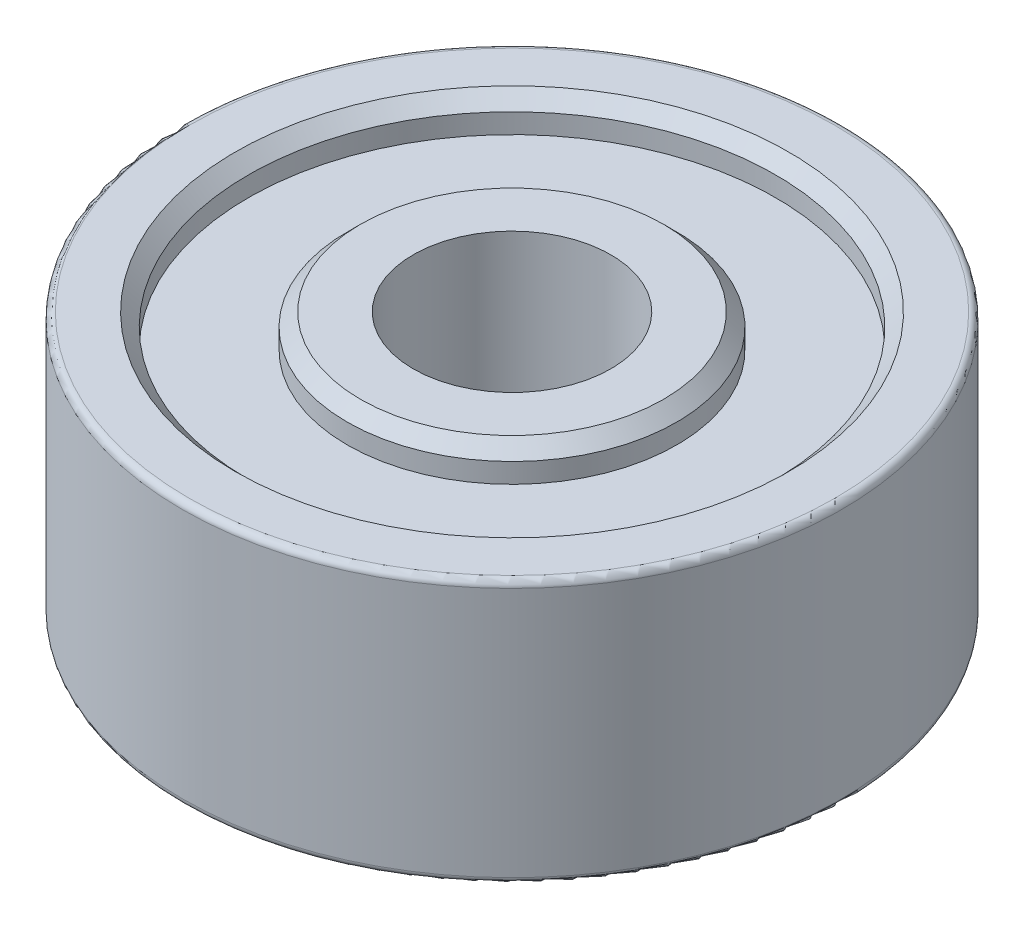
ISO-10303-21;
HEADER;
FILE_DESCRIPTION(('STEP AP214'),'2;1');
FILE_NAME('part.step','',(''),(''),'','','');
FILE_SCHEMA(('AUTOMOTIVE_DESIGN { 1 0 10303 214 1 1 1 1 }'));
ENDSEC;
DATA;
#1=APPLICATION_CONTEXT('core data for automotive mechanical design processes');
#2=APPLICATION_PROTOCOL_DEFINITION('international standard','automotive_design',2000,#1);
#3=PRODUCT_CONTEXT('',#1,'mechanical');
#4=PRODUCT('Part','Part','',(#3));
#5=PRODUCT_RELATED_PRODUCT_CATEGORY('part','',(#4));
#6=PRODUCT_DEFINITION_FORMATION('','',#4);
#7=PRODUCT_DEFINITION_CONTEXT('part definition',#1,'design');
#8=PRODUCT_DEFINITION('design','',#6,#7);
#9=PRODUCT_DEFINITION_SHAPE('','',#8);
#10=(LENGTH_UNIT() NAMED_UNIT(*) SI_UNIT(.MILLI.,.METRE.));
#11=(NAMED_UNIT(*) PLANE_ANGLE_UNIT() SI_UNIT($,.RADIAN.));
#12=(NAMED_UNIT(*) SI_UNIT($,.STERADIAN.) SOLID_ANGLE_UNIT());
#13=UNCERTAINTY_MEASURE_WITH_UNIT(LENGTH_MEASURE(1.E-05),#10,'distance_accuracy_value','');
#14=(GEOMETRIC_REPRESENTATION_CONTEXT(3) GLOBAL_UNCERTAINTY_ASSIGNED_CONTEXT((#13)) GLOBAL_UNIT_ASSIGNED_CONTEXT((#10,
#11,#12)) REPRESENTATION_CONTEXT('',''));
#15=CARTESIAN_POINT('',(0.,0.,0.));
#16=DIRECTION('',(0.,0.,1.));
#17=DIRECTION('',(1.,0.,0.));
#18=AXIS2_PLACEMENT_3D('',#15,#16,#17);
#19=CARTESIAN_POINT('',(0.,-2.,0.));
#20=DIRECTION('',(0.,1.,0.));
#21=DIRECTION('',(0.,0.,1.));
#22=AXIS2_PLACEMENT_3D('',#19,#20,#21);
#23=PLANE('',#22);
#24=CARTESIAN_POINT('',(0.,-2.,0.));
#25=DIRECTION('',(0.,1.,0.));
#26=DIRECTION('',(0.,0.,1.));
#27=AXIS2_PLACEMENT_3D('',#24,#25,#26);
#28=CIRCLE('',#27,2.3);
#29=CARTESIAN_POINT('',(0.,-2.,2.3));
#30=VERTEX_POINT('',#29);
#31=EDGE_CURVE('E66',#30,#30,#28,.F.);
#32=ORIENTED_EDGE('',*,*,#31,.T.);
#33=EDGE_LOOP('',(#32));
#34=FACE_BOUND('',#33,.T.);
#35=CARTESIAN_POINT('',(0.,-2.,0.));
#36=DIRECTION('',(0.,1.,0.));
#37=DIRECTION('',(0.,0.,1.));
#38=AXIS2_PLACEMENT_3D('',#35,#36,#37);
#39=CIRCLE('',#38,1.5);
#40=CARTESIAN_POINT('',(0.,-2.,1.5));
#41=VERTEX_POINT('',#40);
#42=EDGE_CURVE('E79',#41,#41,#39,.T.);
#43=ORIENTED_EDGE('',*,*,#42,.T.);
#44=EDGE_LOOP('',(#43));
#45=FACE_BOUND('',#44,.T.);
#46=ADVANCED_FACE('F34',(#34,#45),#23,.F.);
#47=CARTESIAN_POINT('',(0.,2.,0.));
#48=DIRECTION('',(0.,1.,0.));
#49=DIRECTION('',(0.,0.,1.));
#50=AXIS2_PLACEMENT_3D('',#47,#48,#49);
#51=PLANE('',#50);
#52=CARTESIAN_POINT('',(0.,2.,0.));
#53=DIRECTION('',(0.,1.,0.));
#54=DIRECTION('',(0.,0.,1.));
#55=AXIS2_PLACEMENT_3D('',#52,#53,#54);
#56=CIRCLE('',#55,2.3);
#57=CARTESIAN_POINT('',(0.,2.,2.3));
#58=VERTEX_POINT('',#57);
#59=EDGE_CURVE('E63',#58,#58,#56,.T.);
#60=ORIENTED_EDGE('',*,*,#59,.T.);
#61=EDGE_LOOP('',(#60));
#62=FACE_BOUND('',#61,.T.);
#63=CARTESIAN_POINT('',(0.,2.,0.));
#64=DIRECTION('',(0.,1.,0.));
#65=DIRECTION('',(0.,0.,1.));
#66=AXIS2_PLACEMENT_3D('',#63,#64,#65);
#67=CIRCLE('',#66,1.5);
#68=CARTESIAN_POINT('',(0.,2.,1.5));
#69=VERTEX_POINT('',#68);
#70=EDGE_CURVE('E78',#69,#69,#67,.T.);
#71=ORIENTED_EDGE('',*,*,#70,.F.);
#72=EDGE_LOOP('',(#71));
#73=FACE_BOUND('',#72,.T.);
#74=ADVANCED_FACE('F116',(#62,#73),#51,.T.);
#75=CARTESIAN_POINT('',(0.,2.,0.));
#76=DIRECTION('',(0.,1.,0.));
#77=DIRECTION('',(0.,0.,1.));
#78=AXIS2_PLACEMENT_3D('',#75,#76,#77);
#79=CIRCLE('',#78,4.9);
#80=CARTESIAN_POINT('',(0.,2.,4.9));
#81=VERTEX_POINT('',#80);
#82=EDGE_CURVE('E10',#81,#81,#79,.T.);
#83=ORIENTED_EDGE('',*,*,#82,.T.);
#84=EDGE_LOOP('',(#83));
#85=FACE_BOUND('',#84,.T.);
#86=CARTESIAN_POINT('',(0.,2.,0.));
#87=DIRECTION('',(0.,1.,0.));
#88=DIRECTION('',(0.,0.,1.));
#89=AXIS2_PLACEMENT_3D('',#86,#87,#88);
#90=CIRCLE('',#89,4.2);
#91=CARTESIAN_POINT('',(0.,2.,4.2));
#92=VERTEX_POINT('',#91);
#93=EDGE_CURVE('E54',#92,#92,#90,.F.);
#94=ORIENTED_EDGE('',*,*,#93,.T.);
#95=EDGE_LOOP('',(#94));
#96=FACE_BOUND('',#95,.T.);
#97=ADVANCED_FACE('F123',(#85,#96),#51,.T.);
#98=CARTESIAN_POINT('',(0.,-2.,0.));
#99=DIRECTION('',(0.,1.,0.));
#100=DIRECTION('',(0.,0.,1.));
#101=AXIS2_PLACEMENT_3D('',#98,#99,#100);
#102=CIRCLE('',#101,4.9);
#103=CARTESIAN_POINT('',(0.,-2.,4.9));
#104=VERTEX_POINT('',#103);
#105=EDGE_CURVE('E41',#104,#104,#102,.F.);
#106=ORIENTED_EDGE('',*,*,#105,.T.);
#107=EDGE_LOOP('',(#106));
#108=FACE_BOUND('',#107,.T.);
#109=CARTESIAN_POINT('',(0.,-2.,0.));
#110=DIRECTION('',(0.,1.,0.));
#111=DIRECTION('',(0.,0.,1.));
#112=AXIS2_PLACEMENT_3D('',#109,#110,#111);
#113=CIRCLE('',#112,4.2);
#114=CARTESIAN_POINT('',(0.,-2.,4.2));
#115=VERTEX_POINT('',#114);
#116=EDGE_CURVE('E75',#115,#115,#113,.T.);
#117=ORIENTED_EDGE('',*,*,#116,.T.);
#118=EDGE_LOOP('',(#117));
#119=FACE_BOUND('',#118,.T.);
#120=ADVANCED_FACE('F119',(#108,#119),#23,.F.);
#121=CARTESIAN_POINT('',(0.,2.,0.));
#122=DIRECTION('',(0.,-1.,0.));
#123=DIRECTION('',(0.,0.,-1.));
#124=AXIS2_PLACEMENT_3D('',#121,#122,#123);
#125=CYLINDRICAL_SURFACE('',#124,5.);
#126=CARTESIAN_POINT('',(0.,-1.9,0.));
#127=DIRECTION('',(0.,1.,0.));
#128=DIRECTION('',(0.,0.,1.));
#129=AXIS2_PLACEMENT_3D('',#126,#127,#128);
#130=CIRCLE('',#129,5.);
#131=CARTESIAN_POINT('',(0.,-1.9,5.));
#132=VERTEX_POINT('',#131);
#133=EDGE_CURVE('E45',#132,#132,#130,.T.);
#134=ORIENTED_EDGE('',*,*,#133,.T.);
#135=EDGE_LOOP('',(#134));
#136=FACE_BOUND('',#135,.T.);
#137=CARTESIAN_POINT('',(0.,1.9,0.));
#138=DIRECTION('',(0.,1.,0.));
#139=DIRECTION('',(0.,0.,1.));
#140=AXIS2_PLACEMENT_3D('',#137,#138,#139);
#141=CIRCLE('',#140,5.);
#142=CARTESIAN_POINT('',(0.,1.9,5.));
#143=VERTEX_POINT('',#142);
#144=EDGE_CURVE('E49',#143,#143,#141,.F.);
#145=ORIENTED_EDGE('',*,*,#144,.T.);
#146=EDGE_LOOP('',(#145));
#147=FACE_BOUND('',#146,.T.);
#148=ADVANCED_FACE('F129',(#136,#147),#125,.T.);
#149=CARTESIAN_POINT('',(0.,2.,0.));
#150=DIRECTION('',(0.,-1.,0.));
#151=DIRECTION('',(0.,0.,-1.));
#152=AXIS2_PLACEMENT_3D('',#149,#150,#151);
#153=CYLINDRICAL_SURFACE('',#152,1.5);
#154=ORIENTED_EDGE('',*,*,#70,.T.);
#155=EDGE_LOOP('',(#154));
#156=FACE_BOUND('',#155,.T.);
#157=ORIENTED_EDGE('',*,*,#42,.F.);
#158=EDGE_LOOP('',(#157));
#159=FACE_BOUND('',#158,.T.);
#160=ADVANCED_FACE('F134',(#156,#159),#153,.F.);
#161=CARTESIAN_POINT('',(0.,1.5,0.));
#162=DIRECTION('',(0.,1.,0.));
#163=DIRECTION('',(0.,0.,1.));
#164=AXIS2_PLACEMENT_3D('',#161,#162,#163);
#165=CYLINDRICAL_SURFACE('',#164,4.);
#166=CARTESIAN_POINT('',(0.,1.8,0.));
#167=DIRECTION('',(0.,1.,0.));
#168=DIRECTION('',(0.,0.,1.));
#169=AXIS2_PLACEMENT_3D('',#166,#167,#168);
#170=CIRCLE('',#169,4.);
#171=CARTESIAN_POINT('',(0.,1.8,4.));
#172=VERTEX_POINT('',#171);
#173=EDGE_CURVE('E57',#172,#172,#170,.T.);
#174=ORIENTED_EDGE('',*,*,#173,.T.);
#175=EDGE_LOOP('',(#174));
#176=FACE_BOUND('',#175,.T.);
#177=CARTESIAN_POINT('',(0.,1.5,0.));
#178=DIRECTION('',(0.,1.,0.));
#179=DIRECTION('',(0.,0.,1.));
#180=AXIS2_PLACEMENT_3D('',#177,#178,#179);
#181=CIRCLE('',#180,4.);
#182=CARTESIAN_POINT('',(0.,1.5,4.));
#183=VERTEX_POINT('',#182);
#184=EDGE_CURVE('E82',#183,#183,#181,.T.);
#185=ORIENTED_EDGE('',*,*,#184,.F.);
#186=EDGE_LOOP('',(#185));
#187=FACE_BOUND('',#186,.T.);
#188=ADVANCED_FACE('F145',(#176,#187),#165,.F.);
#189=CARTESIAN_POINT('',(0.,1.5,0.));
#190=DIRECTION('',(0.,1.,0.));
#191=DIRECTION('',(0.,0.,1.));
#192=AXIS2_PLACEMENT_3D('',#189,#190,#191);
#193=PLANE('',#192);
#194=CARTESIAN_POINT('',(0.,1.5,0.));
#195=DIRECTION('',(0.,1.,0.));
#196=DIRECTION('',(0.,0.,1.));
#197=AXIS2_PLACEMENT_3D('',#194,#195,#196);
#198=CIRCLE('',#197,2.5);
#199=CARTESIAN_POINT('',(0.,1.5,2.5));
#200=VERTEX_POINT('',#199);
#201=EDGE_CURVE('E87',#200,#200,#198,.T.);
#202=ORIENTED_EDGE('',*,*,#201,.F.);
#203=EDGE_LOOP('',(#202));
#204=FACE_BOUND('',#203,.T.);
#205=ORIENTED_EDGE('',*,*,#184,.T.);
#206=EDGE_LOOP('',(#205));
#207=FACE_BOUND('',#206,.T.);
#208=ADVANCED_FACE('F149',(#204,#207),#193,.T.);
#209=CARTESIAN_POINT('',(0.,1.5,0.));
#210=DIRECTION('',(0.,1.,0.));
#211=DIRECTION('',(0.,0.,1.));
#212=AXIS2_PLACEMENT_3D('',#209,#210,#211);
#213=CYLINDRICAL_SURFACE('',#212,2.5);
#214=CARTESIAN_POINT('',(0.,1.8,0.));
#215=DIRECTION('',(0.,1.,0.));
#216=DIRECTION('',(0.,0.,1.));
#217=AXIS2_PLACEMENT_3D('',#214,#215,#216);
#218=CIRCLE('',#217,2.5);
#219=CARTESIAN_POINT('',(0.,1.8,2.5));
#220=VERTEX_POINT('',#219);
#221=EDGE_CURVE('E60',#220,#220,#218,.F.);
#222=ORIENTED_EDGE('',*,*,#221,.T.);
#223=EDGE_LOOP('',(#222));
#224=FACE_BOUND('',#223,.T.);
#225=ORIENTED_EDGE('',*,*,#201,.T.);
#226=EDGE_LOOP('',(#225));
#227=FACE_BOUND('',#226,.T.);
#228=ADVANCED_FACE('F153',(#224,#227),#213,.T.);
#229=CARTESIAN_POINT('',(0.,-1.5,0.));
#230=DIRECTION('',(0.,-1.,0.));
#231=DIRECTION('',(0.,0.,1.));
#232=AXIS2_PLACEMENT_3D('',#229,#230,#231);
#233=PLANE('',#232);
#234=CARTESIAN_POINT('',(0.,-1.5,0.));
#235=DIRECTION('',(0.,1.,0.));
#236=DIRECTION('',(0.,0.,1.));
#237=AXIS2_PLACEMENT_3D('',#234,#235,#236);
#238=CIRCLE('',#237,4.);
#239=CARTESIAN_POINT('',(0.,-1.5,4.));
#240=VERTEX_POINT('',#239);
#241=EDGE_CURVE('E90',#240,#240,#238,.T.);
#242=ORIENTED_EDGE('',*,*,#241,.F.);
#243=EDGE_LOOP('',(#242));
#244=FACE_BOUND('',#243,.T.);
#245=CARTESIAN_POINT('',(0.,-1.5,0.));
#246=DIRECTION('',(0.,1.,0.));
#247=DIRECTION('',(0.,0.,1.));
#248=AXIS2_PLACEMENT_3D('',#245,#246,#247);
#249=CIRCLE('',#248,2.5);
#250=CARTESIAN_POINT('',(0.,-1.5,2.5));
#251=VERTEX_POINT('',#250);
#252=EDGE_CURVE('E93',#251,#251,#249,.T.);
#253=ORIENTED_EDGE('',*,*,#252,.T.);
#254=EDGE_LOOP('',(#253));
#255=FACE_BOUND('',#254,.T.);
#256=ADVANCED_FACE('F97',(#244,#255),#233,.T.);
#257=CARTESIAN_POINT('',(0.,-1.5,0.));
#258=DIRECTION('',(0.,-1.,0.));
#259=DIRECTION('',(0.,0.,-1.));
#260=AXIS2_PLACEMENT_3D('',#257,#258,#259);
#261=CYLINDRICAL_SURFACE('',#260,4.);
#262=CARTESIAN_POINT('',(0.,-1.8,0.));
#263=DIRECTION('',(0.,1.,0.));
#264=DIRECTION('',(0.,0.,1.));
#265=AXIS2_PLACEMENT_3D('',#262,#263,#264);
#266=CIRCLE('',#265,4.);
#267=CARTESIAN_POINT('',(0.,-1.8,4.));
#268=VERTEX_POINT('',#267);
#269=EDGE_CURVE('E72',#268,#268,#266,.F.);
#270=ORIENTED_EDGE('',*,*,#269,.T.);
#271=EDGE_LOOP('',(#270));
#272=FACE_BOUND('',#271,.T.);
#273=ORIENTED_EDGE('',*,*,#241,.T.);
#274=EDGE_LOOP('',(#273));
#275=FACE_BOUND('',#274,.T.);
#276=ADVANCED_FACE('F102',(#272,#275),#261,.F.);
#277=CARTESIAN_POINT('',(0.,-1.5,0.));
#278=DIRECTION('',(0.,-1.,0.));
#279=DIRECTION('',(0.,0.,-1.));
#280=AXIS2_PLACEMENT_3D('',#277,#278,#279);
#281=CYLINDRICAL_SURFACE('',#280,2.5);
#282=CARTESIAN_POINT('',(0.,-1.8,0.));
#283=DIRECTION('',(0.,1.,0.));
#284=DIRECTION('',(0.,0.,1.));
#285=AXIS2_PLACEMENT_3D('',#282,#283,#284);
#286=CIRCLE('',#285,2.5);
#287=CARTESIAN_POINT('',(0.,-1.8,2.5));
#288=VERTEX_POINT('',#287);
#289=EDGE_CURVE('E69',#288,#288,#286,.T.);
#290=ORIENTED_EDGE('',*,*,#289,.T.);
#291=EDGE_LOOP('',(#290));
#292=FACE_BOUND('',#291,.T.);
#293=ORIENTED_EDGE('',*,*,#252,.F.);
#294=EDGE_LOOP('',(#293));
#295=FACE_BOUND('',#294,.T.);
#296=ADVANCED_FACE('F99',(#292,#295),#281,.T.);
#297=CARTESIAN_POINT('',(0.,-2.,0.));
#298=DIRECTION('',(0.,-1.,0.));
#299=DIRECTION('',(0.,0.,-1.));
#300=AXIS2_PLACEMENT_3D('',#297,#298,#299);
#301=CONICAL_SURFACE('',#300,4.2,0.785398163397442);
#302=ORIENTED_EDGE('',*,*,#269,.F.);
#303=EDGE_LOOP('',(#302));
#304=FACE_BOUND('',#303,.T.);
#305=ORIENTED_EDGE('',*,*,#116,.F.);
#306=EDGE_LOOP('',(#305));
#307=FACE_BOUND('',#306,.T.);
#308=ADVANCED_FACE('F101',(#304,#307),#301,.F.);
#309=CARTESIAN_POINT('',(0.,-1.8,0.));
#310=DIRECTION('',(0.,1.,0.));
#311=DIRECTION('',(0.,0.,1.));
#312=AXIS2_PLACEMENT_3D('',#309,#310,#311);
#313=CONICAL_SURFACE('',#312,2.5,0.785398163397451);
#314=ORIENTED_EDGE('',*,*,#31,.F.);
#315=EDGE_LOOP('',(#314));
#316=FACE_BOUND('',#315,.T.);
#317=ORIENTED_EDGE('',*,*,#289,.F.);
#318=EDGE_LOOP('',(#317));
#319=FACE_BOUND('',#318,.T.);
#320=ADVANCED_FACE('F109',(#316,#319),#313,.T.);
#321=CARTESIAN_POINT('',(0.,2.,0.));
#322=DIRECTION('',(0.,-1.,0.));
#323=DIRECTION('',(0.,0.,-1.));
#324=AXIS2_PLACEMENT_3D('',#321,#322,#323);
#325=CONICAL_SURFACE('',#324,2.3,0.785398163397445);
#326=ORIENTED_EDGE('',*,*,#221,.F.);
#327=EDGE_LOOP('',(#326));
#328=FACE_BOUND('',#327,.T.);
#329=ORIENTED_EDGE('',*,*,#59,.F.);
#330=EDGE_LOOP('',(#329));
#331=FACE_BOUND('',#330,.T.);
#332=ADVANCED_FACE('F192',(#328,#331),#325,.T.);
#333=CARTESIAN_POINT('',(0.,1.8,0.));
#334=DIRECTION('',(0.,1.,0.));
#335=DIRECTION('',(0.,0.,1.));
#336=AXIS2_PLACEMENT_3D('',#333,#334,#335);
#337=CONICAL_SURFACE('',#336,4.,0.78539816339745);
#338=ORIENTED_EDGE('',*,*,#93,.F.);
#339=EDGE_LOOP('',(#338));
#340=FACE_BOUND('',#339,.T.);
#341=ORIENTED_EDGE('',*,*,#173,.F.);
#342=EDGE_LOOP('',(#341));
#343=FACE_BOUND('',#342,.T.);
#344=ADVANCED_FACE('F202',(#340,#343),#337,.F.);
#345=CARTESIAN_POINT('',(0.,-1.9,0.));
#346=DIRECTION('',(0.,1.,0.));
#347=DIRECTION('',(0.,0.,1.));
#348=AXIS2_PLACEMENT_3D('',#345,#346,#347);
#349=TOROIDAL_SURFACE('',#348,4.9,0.1);
#350=ORIENTED_EDGE('',*,*,#105,.F.);
#351=EDGE_LOOP('',(#350));
#352=FACE_BOUND('',#351,.T.);
#353=ORIENTED_EDGE('',*,*,#133,.F.);
#354=EDGE_LOOP('',(#353));
#355=FACE_BOUND('',#354,.T.);
#356=ADVANCED_FACE('F211',(#352,#355),#349,.T.);
#357=CARTESIAN_POINT('',(0.,1.9,0.));
#358=DIRECTION('',(0.,1.,0.));
#359=DIRECTION('',(0.,0.,1.));
#360=AXIS2_PLACEMENT_3D('',#357,#358,#359);
#361=TOROIDAL_SURFACE('',#360,4.9,0.1);
#362=ORIENTED_EDGE('',*,*,#144,.F.);
#363=EDGE_LOOP('',(#362));
#364=FACE_BOUND('',#363,.T.);
#365=ORIENTED_EDGE('',*,*,#82,.F.);
#366=EDGE_LOOP('',(#365));
#367=FACE_BOUND('',#366,.T.);
#368=ADVANCED_FACE('F36',(#364,#367),#361,.T.);
#369=CLOSED_SHELL('',(#46,#74,#97,#120,#148,#160,#188,#208,#228,#256,#276,#296,#308,#320,#332,
#344,#356,#368));
#370=MANIFOLD_SOLID_BREP('B2',#369);
#371=ADVANCED_BREP_SHAPE_REPRESENTATION('',(#18,#370),#14);
#372=SHAPE_DEFINITION_REPRESENTATION(#9,#371);
ENDSEC;
END-ISO-10303-21;
